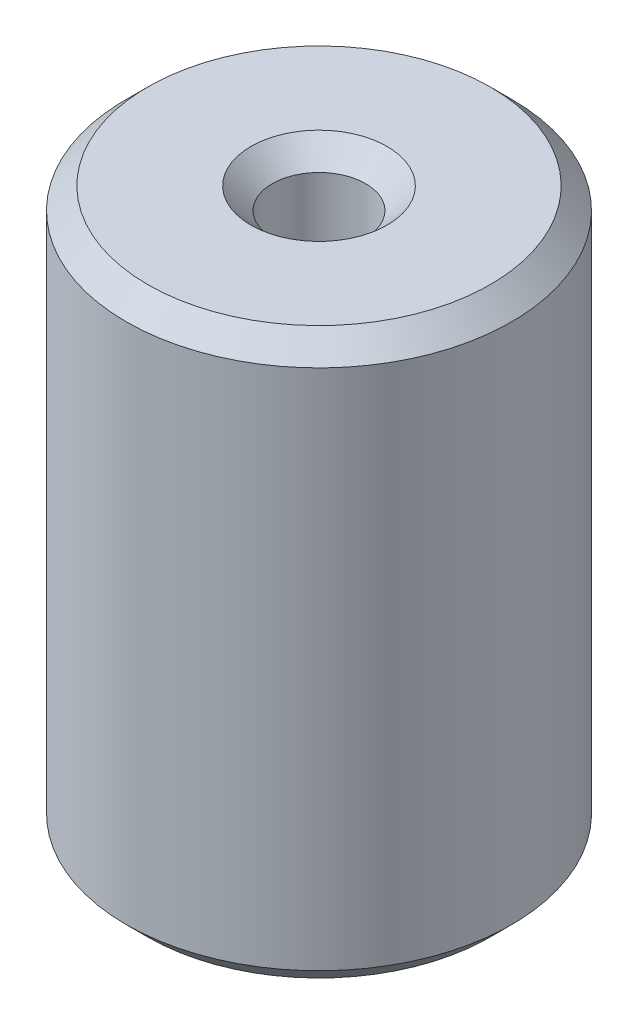
ISO-10303-21;
HEADER;
FILE_DESCRIPTION(('STEP AP214'),'2;1');
FILE_NAME('part.step','',(''),(''),'','','');
FILE_SCHEMA(('AUTOMOTIVE_DESIGN { 1 0 10303 214 1 1 1 1 }'));
ENDSEC;
DATA;
#1=APPLICATION_CONTEXT('core data for automotive mechanical design processes');
#2=APPLICATION_PROTOCOL_DEFINITION('international standard','automotive_design',2000,#1);
#3=PRODUCT_CONTEXT('',#1,'mechanical');
#4=PRODUCT('Part','Part','',(#3));
#5=PRODUCT_RELATED_PRODUCT_CATEGORY('part','',(#4));
#6=PRODUCT_DEFINITION_FORMATION('','',#4);
#7=PRODUCT_DEFINITION_CONTEXT('part definition',#1,'design');
#8=PRODUCT_DEFINITION('design','',#6,#7);
#9=PRODUCT_DEFINITION_SHAPE('','',#8);
#10=(LENGTH_UNIT() NAMED_UNIT(*) SI_UNIT(.MILLI.,.METRE.));
#11=(NAMED_UNIT(*) PLANE_ANGLE_UNIT() SI_UNIT($,.RADIAN.));
#12=(NAMED_UNIT(*) SI_UNIT($,.STERADIAN.) SOLID_ANGLE_UNIT());
#13=UNCERTAINTY_MEASURE_WITH_UNIT(LENGTH_MEASURE(1.E-05),#10,'distance_accuracy_value','');
#14=(GEOMETRIC_REPRESENTATION_CONTEXT(3) GLOBAL_UNCERTAINTY_ASSIGNED_CONTEXT((#13)) GLOBAL_UNIT_ASSIGNED_CONTEXT((#10,
#11,#12)) REPRESENTATION_CONTEXT('',''));
#15=CARTESIAN_POINT('',(0.,0.,0.));
#16=DIRECTION('',(0.,0.,1.));
#17=DIRECTION('',(1.,0.,0.));
#18=AXIS2_PLACEMENT_3D('',#15,#16,#17);
#19=CARTESIAN_POINT('',(0.,14.6603705592034,0.));
#20=DIRECTION('',(0.,-1.,0.));
#21=DIRECTION('',(0.,0.,-1.));
#22=AXIS2_PLACEMENT_3D('',#19,#20,#21);
#23=CYLINDRICAL_SURFACE('',#22,5.);
#24=CARTESIAN_POINT('',(0.,0.557128663883077,0.));
#25=DIRECTION('',(0.,1.,0.));
#26=DIRECTION('',(0.,0.,1.));
#27=AXIS2_PLACEMENT_3D('',#24,#25,#26);
#28=CIRCLE('',#27,5.);
#29=CARTESIAN_POINT('',(0.,0.557128663883077,5.));
#30=VERTEX_POINT('',#29);
#31=EDGE_CURVE('E10',#30,#30,#28,.T.);
#32=ORIENTED_EDGE('',*,*,#31,.T.);
#33=EDGE_LOOP('',(#32));
#34=FACE_BOUND('',#33,.T.);
#35=CARTESIAN_POINT('',(0.,14.1032418953203,0.));
#36=DIRECTION('',(0.,1.,0.));
#37=DIRECTION('',(0.,0.,1.));
#38=AXIS2_PLACEMENT_3D('',#35,#36,#37);
#39=CIRCLE('',#38,5.);
#40=CARTESIAN_POINT('',(0.,14.1032418953203,5.));
#41=VERTEX_POINT('',#40);
#42=EDGE_CURVE('E50',#41,#41,#39,.F.);
#43=ORIENTED_EDGE('',*,*,#42,.T.);
#44=EDGE_LOOP('',(#43));
#45=FACE_BOUND('',#44,.T.);
#46=ADVANCED_FACE('F39',(#34,#45),#23,.T.);
#47=CARTESIAN_POINT('',(0.,14.6603705592034,0.));
#48=DIRECTION('',(0.,1.,0.));
#49=DIRECTION('',(0.,0.,1.));
#50=AXIS2_PLACEMENT_3D('',#47,#48,#49);
#51=PLANE('',#50);
#52=CARTESIAN_POINT('',(0.,14.6603705592034,0.));
#53=DIRECTION('',(0.,1.,0.));
#54=DIRECTION('',(0.,0.,1.));
#55=AXIS2_PLACEMENT_3D('',#52,#53,#54);
#56=CIRCLE('',#55,1.76842883569273);
#57=CARTESIAN_POINT('',(0.,14.6603705592034,1.76842883569273));
#58=VERTEX_POINT('',#57);
#59=EDGE_CURVE('E58',#58,#58,#56,.F.);
#60=ORIENTED_EDGE('',*,*,#59,.T.);
#61=EDGE_LOOP('',(#60));
#62=FACE_BOUND('',#61,.T.);
#63=CARTESIAN_POINT('',(0.,14.6603705592034,0.));
#64=DIRECTION('',(0.,1.,0.));
#65=DIRECTION('',(0.,0.,1.));
#66=AXIS2_PLACEMENT_3D('',#63,#64,#65);
#67=CIRCLE('',#66,4.44287133611692);
#68=CARTESIAN_POINT('',(0.,14.6603705592034,4.44287133611692));
#69=VERTEX_POINT('',#68);
#70=EDGE_CURVE('E61',#69,#69,#67,.T.);
#71=ORIENTED_EDGE('',*,*,#70,.T.);
#72=EDGE_LOOP('',(#71));
#73=FACE_BOUND('',#72,.T.);
#74=ADVANCED_FACE('F88',(#62,#73),#51,.T.);
#75=CARTESIAN_POINT('',(0.,0.,0.));
#76=DIRECTION('',(0.,1.,0.));
#77=DIRECTION('',(0.,0.,1.));
#78=AXIS2_PLACEMENT_3D('',#75,#76,#77);
#79=PLANE('',#78);
#80=CARTESIAN_POINT('',(0.,0.,0.));
#81=DIRECTION('',(0.,1.,0.));
#82=DIRECTION('',(0.,0.,1.));
#83=AXIS2_PLACEMENT_3D('',#80,#81,#82);
#84=CIRCLE('',#83,1.76842883569272);
#85=CARTESIAN_POINT('',(0.,0.,1.76842883569272));
#86=VERTEX_POINT('',#85);
#87=EDGE_CURVE('E51',#86,#86,#84,.T.);
#88=ORIENTED_EDGE('',*,*,#87,.T.);
#89=EDGE_LOOP('',(#88));
#90=FACE_BOUND('',#89,.T.);
#91=CARTESIAN_POINT('',(0.,0.,0.));
#92=DIRECTION('',(0.,1.,0.));
#93=DIRECTION('',(0.,0.,1.));
#94=AXIS2_PLACEMENT_3D('',#91,#92,#93);
#95=CIRCLE('',#94,4.44287133611692);
#96=CARTESIAN_POINT('',(0.,0.,4.44287133611692));
#97=VERTEX_POINT('',#96);
#98=EDGE_CURVE('E54',#97,#97,#95,.F.);
#99=ORIENTED_EDGE('',*,*,#98,.T.);
#100=EDGE_LOOP('',(#99));
#101=FACE_BOUND('',#100,.T.);
#102=ADVANCED_FACE('F83',(#90,#101),#79,.F.);
#103=CARTESIAN_POINT('',(0.,14.6603705592034,0.));
#104=DIRECTION('',(0.,-1.,0.));
#105=DIRECTION('',(0.,0.,-1.));
#106=AXIS2_PLACEMENT_3D('',#103,#104,#105);
#107=CYLINDRICAL_SURFACE('',#106,1.21130017180964);
#108=CARTESIAN_POINT('',(0.,14.1032418953203,0.));
#109=DIRECTION('',(0.,1.,0.));
#110=DIRECTION('',(0.,0.,1.));
#111=AXIS2_PLACEMENT_3D('',#108,#109,#110);
#112=CIRCLE('',#111,1.21130017180964);
#113=CARTESIAN_POINT('',(0.,14.1032418953203,1.21130017180964));
#114=VERTEX_POINT('',#113);
#115=EDGE_CURVE('E67',#114,#114,#112,.T.);
#116=ORIENTED_EDGE('',*,*,#115,.T.);
#117=EDGE_LOOP('',(#116));
#118=FACE_BOUND('',#117,.T.);
#119=CARTESIAN_POINT('',(0.,0.557128663883083,0.));
#120=DIRECTION('',(0.,1.,0.));
#121=DIRECTION('',(0.,0.,1.));
#122=AXIS2_PLACEMENT_3D('',#119,#120,#121);
#123=CIRCLE('',#122,1.21130017180964);
#124=CARTESIAN_POINT('',(0.,0.557128663883083,1.21130017180964));
#125=VERTEX_POINT('',#124);
#126=EDGE_CURVE('E69',#125,#125,#123,.F.);
#127=ORIENTED_EDGE('',*,*,#126,.T.);
#128=EDGE_LOOP('',(#127));
#129=FACE_BOUND('',#128,.T.);
#130=ADVANCED_FACE('F71',(#118,#129),#107,.F.);
#131=CARTESIAN_POINT('',(0.,14.1032418953203,0.));
#132=DIRECTION('',(0.,1.,0.));
#133=DIRECTION('',(0.,0.,1.));
#134=AXIS2_PLACEMENT_3D('',#131,#132,#133);
#135=CONICAL_SURFACE('',#134,1.21130017180964,0.785398163397451);
#136=ORIENTED_EDGE('',*,*,#59,.F.);
#137=EDGE_LOOP('',(#136));
#138=FACE_BOUND('',#137,.T.);
#139=ORIENTED_EDGE('',*,*,#115,.F.);
#140=EDGE_LOOP('',(#139));
#141=FACE_BOUND('',#140,.T.);
#142=ADVANCED_FACE('F77',(#138,#141),#135,.F.);
#143=CARTESIAN_POINT('',(0.,0.,0.));
#144=DIRECTION('',(0.,-1.,0.));
#145=DIRECTION('',(0.,0.,-1.));
#146=AXIS2_PLACEMENT_3D('',#143,#144,#145);
#147=CONICAL_SURFACE('',#146,1.76842883569272,0.785398163397444);
#148=ORIENTED_EDGE('',*,*,#126,.F.);
#149=EDGE_LOOP('',(#148));
#150=FACE_BOUND('',#149,.T.);
#151=ORIENTED_EDGE('',*,*,#87,.F.);
#152=EDGE_LOOP('',(#151));
#153=FACE_BOUND('',#152,.T.);
#154=ADVANCED_FACE('F73',(#150,#153),#147,.F.);
#155=CARTESIAN_POINT('',(0.,0.557128663883077,0.));
#156=DIRECTION('',(0.,1.,0.));
#157=DIRECTION('',(0.,0.,1.));
#158=AXIS2_PLACEMENT_3D('',#155,#156,#157);
#159=CONICAL_SURFACE('',#158,5.,0.785398163397452);
#160=ORIENTED_EDGE('',*,*,#98,.F.);
#161=EDGE_LOOP('',(#160));
#162=FACE_BOUND('',#161,.T.);
#163=ORIENTED_EDGE('',*,*,#31,.F.);
#164=EDGE_LOOP('',(#163));
#165=FACE_BOUND('',#164,.T.);
#166=ADVANCED_FACE('F76',(#162,#165),#159,.T.);
#167=CARTESIAN_POINT('',(0.,14.6603705592034,0.));
#168=DIRECTION('',(0.,-1.,0.));
#169=DIRECTION('',(0.,0.,-1.));
#170=AXIS2_PLACEMENT_3D('',#167,#168,#169);
#171=CONICAL_SURFACE('',#170,4.44287133611692,0.785398163397444);
#172=ORIENTED_EDGE('',*,*,#42,.F.);
#173=EDGE_LOOP('',(#172));
#174=FACE_BOUND('',#173,.T.);
#175=ORIENTED_EDGE('',*,*,#70,.F.);
#176=EDGE_LOOP('',(#175));
#177=FACE_BOUND('',#176,.T.);
#178=ADVANCED_FACE('F45',(#174,#177),#171,.T.);
#179=CLOSED_SHELL('',(#46,#74,#102,#130,#142,#154,#166,#178));
#180=MANIFOLD_SOLID_BREP('B2',#179);
#181=ADVANCED_BREP_SHAPE_REPRESENTATION('',(#18,#180),#14);
#182=SHAPE_DEFINITION_REPRESENTATION(#9,#181);
ENDSEC;
END-ISO-10303-21;
